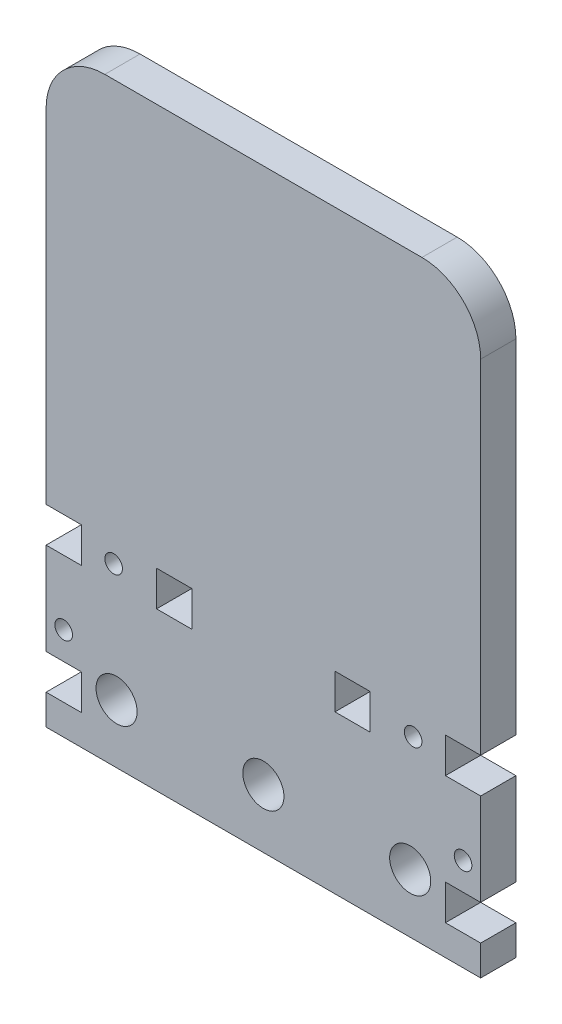
ISO-10303-21;
HEADER;
FILE_DESCRIPTION(('STEP AP214'),'2;1');
FILE_NAME('part.step','',(''),(''),'','','');
FILE_SCHEMA(('AUTOMOTIVE_DESIGN { 1 0 10303 214 1 1 1 1 }'));
ENDSEC;
DATA;
#1=APPLICATION_CONTEXT('core data for automotive mechanical design processes');
#2=APPLICATION_PROTOCOL_DEFINITION('international standard','automotive_design',2000,#1);
#3=PRODUCT_CONTEXT('',#1,'mechanical');
#4=PRODUCT('Part','Part','',(#3));
#5=PRODUCT_RELATED_PRODUCT_CATEGORY('part','',(#4));
#6=PRODUCT_DEFINITION_FORMATION('','',#4);
#7=PRODUCT_DEFINITION_CONTEXT('part definition',#1,'design');
#8=PRODUCT_DEFINITION('design','',#6,#7);
#9=PRODUCT_DEFINITION_SHAPE('','',#8);
#10=(LENGTH_UNIT() NAMED_UNIT(*) SI_UNIT(.MILLI.,.METRE.));
#11=(NAMED_UNIT(*) PLANE_ANGLE_UNIT() SI_UNIT($,.RADIAN.));
#12=(NAMED_UNIT(*) SI_UNIT($,.STERADIAN.) SOLID_ANGLE_UNIT());
#13=UNCERTAINTY_MEASURE_WITH_UNIT(LENGTH_MEASURE(1.E-05),#10,'distance_accuracy_value','');
#14=(GEOMETRIC_REPRESENTATION_CONTEXT(3) GLOBAL_UNCERTAINTY_ASSIGNED_CONTEXT((#13)) GLOBAL_UNIT_ASSIGNED_CONTEXT((#10,
#11,#12)) REPRESENTATION_CONTEXT('',''));
#15=CARTESIAN_POINT('',(0.,0.,0.));
#16=DIRECTION('',(0.,0.,1.));
#17=DIRECTION('',(1.,0.,0.));
#18=AXIS2_PLACEMENT_3D('',#15,#16,#17);
#19=CARTESIAN_POINT('',(0.,32.84,6.));
#20=DIRECTION('',(0.,-1.,0.));
#21=DIRECTION('',(0.,0.,-1.));
#22=AXIS2_PLACEMENT_3D('',#19,#20,#21);
#23=PLANE('',#22);
#24=DIRECTION('',(-1.,0.,0.));
#25=VECTOR('',#24,1.);
#26=CARTESIAN_POINT('',(0.,32.84,0.));
#27=LINE('',#26,#25);
#28=CARTESIAN_POINT('',(55.19,32.84,0.));
#29=VERTEX_POINT('',#28);
#30=CARTESIAN_POINT('',(49.19,32.84,0.));
#31=VERTEX_POINT('',#30);
#32=EDGE_CURVE('E408',#29,#31,#27,.T.);
#33=ORIENTED_EDGE('',*,*,#32,.F.);
#34=DIRECTION('',(0.,0.,-1.));
#35=VECTOR('',#34,1.);
#36=CARTESIAN_POINT('',(55.19,32.84,6.));
#37=LINE('',#36,#35);
#38=CARTESIAN_POINT('',(55.19,32.84,6.));
#39=VERTEX_POINT('',#38);
#40=EDGE_CURVE('E11',#39,#29,#37,.T.);
#41=ORIENTED_EDGE('',*,*,#40,.F.);
#42=DIRECTION('',(-1.,0.,0.));
#43=VECTOR('',#42,1.);
#44=CARTESIAN_POINT('',(0.,32.84,6.));
#45=LINE('',#44,#43);
#46=CARTESIAN_POINT('',(49.19,32.84,6.));
#47=VERTEX_POINT('',#46);
#48=EDGE_CURVE('E249',#39,#47,#45,.T.);
#49=ORIENTED_EDGE('',*,*,#48,.T.);
#50=DIRECTION('',(0.,0.,-1.));
#51=VECTOR('',#50,1.);
#52=CARTESIAN_POINT('',(49.19,32.84,6.));
#53=LINE('',#52,#51);
#54=EDGE_CURVE('E51',#47,#31,#53,.T.);
#55=ORIENTED_EDGE('',*,*,#54,.T.);
#56=EDGE_LOOP('',(#33,#41,#49,#55));
#57=FACE_BOUND('',#56,.T.);
#58=ADVANCED_FACE('F32',(#57),#23,.T.);
#59=CARTESIAN_POINT('',(55.19,0.,6.));
#60=DIRECTION('',(1.,0.,0.));
#61=DIRECTION('',(0.,0.,-1.));
#62=AXIS2_PLACEMENT_3D('',#59,#60,#61);
#63=PLANE('',#62);
#64=DIRECTION('',(0.,-1.,0.));
#65=VECTOR('',#64,1.);
#66=CARTESIAN_POINT('',(55.19,0.,0.));
#67=LINE('',#66,#65);
#68=CARTESIAN_POINT('',(55.19,26.84,0.));
#69=VERTEX_POINT('',#68);
#70=EDGE_CURVE('E254',#29,#69,#67,.T.);
#71=ORIENTED_EDGE('',*,*,#70,.T.);
#72=DIRECTION('',(0.,0.,-1.));
#73=VECTOR('',#72,1.);
#74=CARTESIAN_POINT('',(55.19,26.84,6.));
#75=LINE('',#74,#73);
#76=CARTESIAN_POINT('',(55.19,26.84,6.));
#77=VERTEX_POINT('',#76);
#78=EDGE_CURVE('E42',#77,#69,#75,.T.);
#79=ORIENTED_EDGE('',*,*,#78,.F.);
#80=DIRECTION('',(0.,-1.,0.));
#81=VECTOR('',#80,1.);
#82=CARTESIAN_POINT('',(55.19,0.,6.));
#83=LINE('',#82,#81);
#84=EDGE_CURVE('E244',#39,#77,#83,.T.);
#85=ORIENTED_EDGE('',*,*,#84,.F.);
#86=ORIENTED_EDGE('',*,*,#40,.T.);
#87=EDGE_LOOP('',(#71,#79,#85,#86));
#88=FACE_BOUND('',#87,.T.);
#89=ADVANCED_FACE('F252',(#88),#63,.F.);
#90=CARTESIAN_POINT('',(0.,26.84,6.));
#91=DIRECTION('',(0.,-1.,0.));
#92=DIRECTION('',(0.,0.,-1.));
#93=AXIS2_PLACEMENT_3D('',#90,#91,#92);
#94=PLANE('',#93);
#95=DIRECTION('',(-1.,0.,0.));
#96=VECTOR('',#95,1.);
#97=CARTESIAN_POINT('',(0.,26.84,0.));
#98=LINE('',#97,#96);
#99=CARTESIAN_POINT('',(49.19,26.84,0.));
#100=VERTEX_POINT('',#99);
#101=EDGE_CURVE('E411',#69,#100,#98,.T.);
#102=ORIENTED_EDGE('',*,*,#101,.T.);
#103=DIRECTION('',(0.,0.,-1.));
#104=VECTOR('',#103,1.);
#105=CARTESIAN_POINT('',(49.19,26.84,6.));
#106=LINE('',#105,#104);
#107=CARTESIAN_POINT('',(49.19,26.84,6.));
#108=VERTEX_POINT('',#107);
#109=EDGE_CURVE('E143',#108,#100,#106,.T.);
#110=ORIENTED_EDGE('',*,*,#109,.F.);
#111=DIRECTION('',(-1.,0.,0.));
#112=VECTOR('',#111,1.);
#113=CARTESIAN_POINT('',(0.,26.84,6.));
#114=LINE('',#113,#112);
#115=EDGE_CURVE('E236',#77,#108,#114,.T.);
#116=ORIENTED_EDGE('',*,*,#115,.F.);
#117=ORIENTED_EDGE('',*,*,#78,.T.);
#118=EDGE_LOOP('',(#102,#110,#116,#117));
#119=FACE_BOUND('',#118,.T.);
#120=ADVANCED_FACE('F238',(#119),#94,.F.);
#121=CARTESIAN_POINT('',(0.,32.84,6.));
#122=DIRECTION('',(0.,1.,0.));
#123=DIRECTION('',(0.,0.,1.));
#124=AXIS2_PLACEMENT_3D('',#121,#122,#123);
#125=PLANE('',#124);
#126=DIRECTION('',(1.,0.,0.));
#127=VECTOR('',#126,1.);
#128=CARTESIAN_POINT('',(0.,32.84,0.));
#129=LINE('',#128,#127);
#130=CARTESIAN_POINT('',(18.81,32.84,0.));
#131=VERTEX_POINT('',#130);
#132=CARTESIAN_POINT('',(24.81,32.84,0.));
#133=VERTEX_POINT('',#132);
#134=EDGE_CURVE('E390',#131,#133,#129,.T.);
#135=ORIENTED_EDGE('',*,*,#134,.T.);
#136=DIRECTION('',(0.,0.,-1.));
#137=VECTOR('',#136,1.);
#138=CARTESIAN_POINT('',(24.81,32.84,6.));
#139=LINE('',#138,#137);
#140=CARTESIAN_POINT('',(24.81,32.84,6.));
#141=VERTEX_POINT('',#140);
#142=EDGE_CURVE('E265',#141,#133,#139,.T.);
#143=ORIENTED_EDGE('',*,*,#142,.F.);
#144=DIRECTION('',(1.,0.,0.));
#145=VECTOR('',#144,1.);
#146=CARTESIAN_POINT('',(0.,32.84,6.));
#147=LINE('',#146,#145);
#148=CARTESIAN_POINT('',(18.81,32.84,6.));
#149=VERTEX_POINT('',#148);
#150=EDGE_CURVE('E475',#149,#141,#147,.T.);
#151=ORIENTED_EDGE('',*,*,#150,.F.);
#152=DIRECTION('',(0.,0.,-1.));
#153=VECTOR('',#152,1.);
#154=CARTESIAN_POINT('',(18.81,32.84,6.));
#155=LINE('',#154,#153);
#156=EDGE_CURVE('E259',#149,#131,#155,.T.);
#157=ORIENTED_EDGE('',*,*,#156,.T.);
#158=EDGE_LOOP('',(#135,#143,#151,#157));
#159=FACE_BOUND('',#158,.T.);
#160=ADVANCED_FACE('F585',(#159),#125,.F.);
#161=CARTESIAN_POINT('',(24.81,0.,6.));
#162=DIRECTION('',(1.,0.,0.));
#163=DIRECTION('',(0.,0.,-1.));
#164=AXIS2_PLACEMENT_3D('',#161,#162,#163);
#165=PLANE('',#164);
#166=DIRECTION('',(0.,-1.,0.));
#167=VECTOR('',#166,1.);
#168=CARTESIAN_POINT('',(24.81,0.,0.));
#169=LINE('',#168,#167);
#170=CARTESIAN_POINT('',(24.81,26.84,0.));
#171=VERTEX_POINT('',#170);
#172=EDGE_CURVE('E393',#133,#171,#169,.T.);
#173=ORIENTED_EDGE('',*,*,#172,.T.);
#174=DIRECTION('',(0.,0.,-1.));
#175=VECTOR('',#174,1.);
#176=CARTESIAN_POINT('',(24.81,26.84,6.));
#177=LINE('',#176,#175);
#178=CARTESIAN_POINT('',(24.81,26.84,6.));
#179=VERTEX_POINT('',#178);
#180=EDGE_CURVE('E263',#179,#171,#177,.T.);
#181=ORIENTED_EDGE('',*,*,#180,.F.);
#182=DIRECTION('',(0.,-1.,0.));
#183=VECTOR('',#182,1.);
#184=CARTESIAN_POINT('',(24.81,0.,6.));
#185=LINE('',#184,#183);
#186=EDGE_CURVE('E478',#141,#179,#185,.T.);
#187=ORIENTED_EDGE('',*,*,#186,.F.);
#188=ORIENTED_EDGE('',*,*,#142,.T.);
#189=EDGE_LOOP('',(#173,#181,#187,#188));
#190=FACE_BOUND('',#189,.T.);
#191=ADVANCED_FACE('F581',(#190),#165,.F.);
#192=CARTESIAN_POINT('',(0.,26.84,6.));
#193=DIRECTION('',(0.,1.,0.));
#194=DIRECTION('',(0.,0.,1.));
#195=AXIS2_PLACEMENT_3D('',#192,#193,#194);
#196=PLANE('',#195);
#197=DIRECTION('',(1.,0.,0.));
#198=VECTOR('',#197,1.);
#199=CARTESIAN_POINT('',(0.,26.84,0.));
#200=LINE('',#199,#198);
#201=CARTESIAN_POINT('',(18.81,26.84,0.));
#202=VERTEX_POINT('',#201);
#203=EDGE_CURVE('E396',#202,#171,#200,.T.);
#204=ORIENTED_EDGE('',*,*,#203,.F.);
#205=DIRECTION('',(0.,0.,-1.));
#206=VECTOR('',#205,1.);
#207=CARTESIAN_POINT('',(18.81,26.84,6.));
#208=LINE('',#207,#206);
#209=CARTESIAN_POINT('',(18.81,26.84,6.));
#210=VERTEX_POINT('',#209);
#211=EDGE_CURVE('E261',#210,#202,#208,.T.);
#212=ORIENTED_EDGE('',*,*,#211,.F.);
#213=DIRECTION('',(1.,0.,0.));
#214=VECTOR('',#213,1.);
#215=CARTESIAN_POINT('',(0.,26.84,6.));
#216=LINE('',#215,#214);
#217=EDGE_CURVE('E480',#210,#179,#216,.T.);
#218=ORIENTED_EDGE('',*,*,#217,.T.);
#219=ORIENTED_EDGE('',*,*,#180,.T.);
#220=EDGE_LOOP('',(#204,#212,#218,#219));
#221=FACE_BOUND('',#220,.T.);
#222=ADVANCED_FACE('F578',(#221),#196,.T.);
#223=CARTESIAN_POINT('',(64.,91.26,6.));
#224=DIRECTION('',(0.,0.,-1.));
#225=DIRECTION('',(-1.,0.,0.));
#226=AXIS2_PLACEMENT_3D('',#223,#224,#225);
#227=CYLINDRICAL_SURFACE('',#226,9.99999999999999);
#228=CARTESIAN_POINT('',(64.,91.26,0.));
#229=DIRECTION('',(0.,0.,1.));
#230=DIRECTION('',(1.,0.,0.));
#231=AXIS2_PLACEMENT_3D('',#228,#229,#230);
#232=CIRCLE('',#231,9.99999999999999);
#233=CARTESIAN_POINT('',(63.9999999999999,101.26,0.));
#234=VERTEX_POINT('',#233);
#235=CARTESIAN_POINT('',(74.,91.2599999999999,0.));
#236=VERTEX_POINT('',#235);
#237=EDGE_CURVE('E326',#234,#236,#232,.F.);
#238=ORIENTED_EDGE('',*,*,#237,.F.);
#239=DIRECTION('',(0.,0.,-1.));
#240=VECTOR('',#239,1.);
#241=CARTESIAN_POINT('',(63.9999999999999,101.26,6.));
#242=LINE('',#241,#240);
#243=CARTESIAN_POINT('',(63.9999999999999,101.26,6.));
#244=VERTEX_POINT('',#243);
#245=EDGE_CURVE('E36',#244,#234,#242,.T.);
#246=ORIENTED_EDGE('',*,*,#245,.F.);
#247=CARTESIAN_POINT('',(64.,91.26,6.));
#248=DIRECTION('',(0.,0.,1.));
#249=DIRECTION('',(1.,0.,0.));
#250=AXIS2_PLACEMENT_3D('',#247,#248,#249);
#251=CIRCLE('',#250,9.99999999999999);
#252=CARTESIAN_POINT('',(74.,91.2599999999999,6.));
#253=VERTEX_POINT('',#252);
#254=EDGE_CURVE('E418',#244,#253,#251,.F.);
#255=ORIENTED_EDGE('',*,*,#254,.T.);
#256=DIRECTION('',(0.,0.,-1.));
#257=VECTOR('',#256,1.);
#258=CARTESIAN_POINT('',(74.,91.2599999999999,6.));
#259=LINE('',#258,#257);
#260=EDGE_CURVE('E268',#253,#236,#259,.T.);
#261=ORIENTED_EDGE('',*,*,#260,.T.);
#262=EDGE_LOOP('',(#238,#246,#255,#261));
#263=FACE_BOUND('',#262,.T.);
#264=ADVANCED_FACE('F327',(#263),#227,.T.);
#265=CARTESIAN_POINT('',(0.,101.26,6.));
#266=DIRECTION('',(0.,1.,0.));
#267=DIRECTION('',(0.,0.,1.));
#268=AXIS2_PLACEMENT_3D('',#265,#266,#267);
#269=PLANE('',#268);
#270=DIRECTION('',(1.,0.,0.));
#271=VECTOR('',#270,1.);
#272=CARTESIAN_POINT('',(0.,101.26,0.));
#273=LINE('',#272,#271);
#274=CARTESIAN_POINT('',(10.0000000000001,101.26,0.));
#275=VERTEX_POINT('',#274);
#276=EDGE_CURVE('E321',#275,#234,#273,.T.);
#277=ORIENTED_EDGE('',*,*,#276,.F.);
#278=DIRECTION('',(0.,0.,-1.));
#279=VECTOR('',#278,1.);
#280=CARTESIAN_POINT('',(10.0000000000001,101.26,6.));
#281=LINE('',#280,#279);
#282=CARTESIAN_POINT('',(10.0000000000001,101.26,6.));
#283=VERTEX_POINT('',#282);
#284=EDGE_CURVE('E312',#283,#275,#281,.T.);
#285=ORIENTED_EDGE('',*,*,#284,.F.);
#286=DIRECTION('',(1.,0.,0.));
#287=VECTOR('',#286,1.);
#288=CARTESIAN_POINT('',(0.,101.26,6.));
#289=LINE('',#288,#287);
#290=EDGE_CURVE('E324',#283,#244,#289,.T.);
#291=ORIENTED_EDGE('',*,*,#290,.T.);
#292=ORIENTED_EDGE('',*,*,#245,.T.);
#293=EDGE_LOOP('',(#277,#285,#291,#292));
#294=FACE_BOUND('',#293,.T.);
#295=ADVANCED_FACE('F319',(#294),#269,.T.);
#296=CARTESIAN_POINT('',(10.,91.26,6.));
#297=DIRECTION('',(0.,0.,-1.));
#298=DIRECTION('',(-1.,0.,0.));
#299=AXIS2_PLACEMENT_3D('',#296,#297,#298);
#300=CYLINDRICAL_SURFACE('',#299,10.);
#301=CARTESIAN_POINT('',(10.,91.26,0.));
#302=DIRECTION('',(0.,0.,1.));
#303=DIRECTION('',(1.,0.,0.));
#304=AXIS2_PLACEMENT_3D('',#301,#302,#303);
#305=CIRCLE('',#304,10.);
#306=CARTESIAN_POINT('',(0.,91.2599999999999,0.));
#307=VERTEX_POINT('',#306);
#308=EDGE_CURVE('E337',#307,#275,#305,.F.);
#309=ORIENTED_EDGE('',*,*,#308,.F.);
#310=DIRECTION('',(0.,0.,-1.));
#311=VECTOR('',#310,1.);
#312=CARTESIAN_POINT('',(0.,91.2599999999999,6.));
#313=LINE('',#312,#311);
#314=CARTESIAN_POINT('',(0.,91.2599999999999,6.));
#315=VERTEX_POINT('',#314);
#316=EDGE_CURVE('E311',#315,#307,#313,.T.);
#317=ORIENTED_EDGE('',*,*,#316,.F.);
#318=CARTESIAN_POINT('',(10.,91.26,6.));
#319=DIRECTION('',(0.,0.,1.));
#320=DIRECTION('',(1.,0.,0.));
#321=AXIS2_PLACEMENT_3D('',#318,#319,#320);
#322=CIRCLE('',#321,10.);
#323=EDGE_CURVE('E428',#315,#283,#322,.F.);
#324=ORIENTED_EDGE('',*,*,#323,.T.);
#325=ORIENTED_EDGE('',*,*,#284,.T.);
#326=EDGE_LOOP('',(#309,#317,#324,#325));
#327=FACE_BOUND('',#326,.T.);
#328=ADVANCED_FACE('F652',(#327),#300,.T.);
#329=CARTESIAN_POINT('',(0.,0.,6.));
#330=DIRECTION('',(-1.,0.,0.));
#331=DIRECTION('',(0.,0.,1.));
#332=AXIS2_PLACEMENT_3D('',#329,#330,#331);
#333=PLANE('',#332);
#334=DIRECTION('',(0.,1.,0.));
#335=VECTOR('',#334,1.);
#336=CARTESIAN_POINT('',(0.,0.,0.));
#337=LINE('',#336,#335);
#338=CARTESIAN_POINT('',(0.,32.84,0.));
#339=VERTEX_POINT('',#338);
#340=EDGE_CURVE('E339',#339,#307,#337,.T.);
#341=ORIENTED_EDGE('',*,*,#340,.F.);
#342=DIRECTION('',(0.,0.,-1.));
#343=VECTOR('',#342,1.);
#344=CARTESIAN_POINT('',(0.,32.84,6.));
#345=LINE('',#344,#343);
#346=CARTESIAN_POINT('',(0.,32.84,6.));
#347=VERTEX_POINT('',#346);
#348=EDGE_CURVE('E309',#347,#339,#345,.T.);
#349=ORIENTED_EDGE('',*,*,#348,.F.);
#350=DIRECTION('',(0.,1.,0.));
#351=VECTOR('',#350,1.);
#352=CARTESIAN_POINT('',(0.,0.,6.));
#353=LINE('',#352,#351);
#354=EDGE_CURVE('E430',#347,#315,#353,.T.);
#355=ORIENTED_EDGE('',*,*,#354,.T.);
#356=ORIENTED_EDGE('',*,*,#316,.T.);
#357=EDGE_LOOP('',(#341,#349,#355,#356));
#358=FACE_BOUND('',#357,.T.);
#359=ADVANCED_FACE('F627',(#358),#333,.T.);
#360=CARTESIAN_POINT('',(0.,32.84,6.));
#361=DIRECTION('',(0.,1.,0.));
#362=DIRECTION('',(0.,0.,1.));
#363=AXIS2_PLACEMENT_3D('',#360,#361,#362);
#364=PLANE('',#363);
#365=DIRECTION('',(1.,0.,0.));
#366=VECTOR('',#365,1.);
#367=CARTESIAN_POINT('',(0.,32.84,0.));
#368=LINE('',#367,#366);
#369=CARTESIAN_POINT('',(6.,32.84,0.));
#370=VERTEX_POINT('',#369);
#371=EDGE_CURVE('E344',#339,#370,#368,.T.);
#372=ORIENTED_EDGE('',*,*,#371,.T.);
#373=DIRECTION('',(0.,0.,-1.));
#374=VECTOR('',#373,1.);
#375=CARTESIAN_POINT('',(6.,32.84,6.));
#376=LINE('',#375,#374);
#377=CARTESIAN_POINT('',(6.,32.84,6.));
#378=VERTEX_POINT('',#377);
#379=EDGE_CURVE('E306',#378,#370,#376,.T.);
#380=ORIENTED_EDGE('',*,*,#379,.F.);
#381=DIRECTION('',(1.,0.,0.));
#382=VECTOR('',#381,1.);
#383=CARTESIAN_POINT('',(0.,32.84,6.));
#384=LINE('',#383,#382);
#385=EDGE_CURVE('E433',#347,#378,#384,.T.);
#386=ORIENTED_EDGE('',*,*,#385,.F.);
#387=ORIENTED_EDGE('',*,*,#348,.T.);
#388=EDGE_LOOP('',(#372,#380,#386,#387));
#389=FACE_BOUND('',#388,.T.);
#390=ADVANCED_FACE('F647',(#389),#364,.F.);
#391=CARTESIAN_POINT('',(6.00000000000001,0.,6.));
#392=DIRECTION('',(1.,0.,0.));
#393=DIRECTION('',(0.,1.,0.));
#394=AXIS2_PLACEMENT_3D('',#391,#392,#393);
#395=PLANE('',#394);
#396=DIRECTION('',(0.,-1.,0.));
#397=VECTOR('',#396,1.);
#398=CARTESIAN_POINT('',(6.00000000000001,0.,0.));
#399=LINE('',#398,#397);
#400=CARTESIAN_POINT('',(6.,26.84,0.));
#401=VERTEX_POINT('',#400);
#402=EDGE_CURVE('E349',#370,#401,#399,.T.);
#403=ORIENTED_EDGE('',*,*,#402,.T.);
#404=DIRECTION('',(0.,0.,-1.));
#405=VECTOR('',#404,1.);
#406=CARTESIAN_POINT('',(6.,26.84,6.));
#407=LINE('',#406,#405);
#408=CARTESIAN_POINT('',(6.,26.84,6.));
#409=VERTEX_POINT('',#408);
#410=EDGE_CURVE('E304',#409,#401,#407,.T.);
#411=ORIENTED_EDGE('',*,*,#410,.F.);
#412=DIRECTION('',(0.,-1.,0.));
#413=VECTOR('',#412,1.);
#414=CARTESIAN_POINT('',(6.00000000000001,0.,6.));
#415=LINE('',#414,#413);
#416=EDGE_CURVE('E438',#378,#409,#415,.T.);
#417=ORIENTED_EDGE('',*,*,#416,.F.);
#418=ORIENTED_EDGE('',*,*,#379,.T.);
#419=EDGE_LOOP('',(#403,#411,#417,#418));
#420=FACE_BOUND('',#419,.T.);
#421=ADVANCED_FACE('F643',(#420),#395,.F.);
#422=CARTESIAN_POINT('',(0.,26.84,6.));
#423=DIRECTION('',(0.,1.,0.));
#424=DIRECTION('',(0.,0.,1.));
#425=AXIS2_PLACEMENT_3D('',#422,#423,#424);
#426=PLANE('',#425);
#427=DIRECTION('',(1.,0.,0.));
#428=VECTOR('',#427,1.);
#429=CARTESIAN_POINT('',(0.,26.84,0.));
#430=LINE('',#429,#428);
#431=CARTESIAN_POINT('',(0.,26.84,0.));
#432=VERTEX_POINT('',#431);
#433=EDGE_CURVE('E352',#432,#401,#430,.T.);
#434=ORIENTED_EDGE('',*,*,#433,.F.);
#435=DIRECTION('',(0.,0.,-1.));
#436=VECTOR('',#435,1.);
#437=CARTESIAN_POINT('',(0.,26.84,6.));
#438=LINE('',#437,#436);
#439=CARTESIAN_POINT('',(0.,26.84,6.));
#440=VERTEX_POINT('',#439);
#441=EDGE_CURVE('E302',#440,#432,#438,.T.);
#442=ORIENTED_EDGE('',*,*,#441,.F.);
#443=DIRECTION('',(1.,0.,0.));
#444=VECTOR('',#443,1.);
#445=CARTESIAN_POINT('',(0.,26.84,6.));
#446=LINE('',#445,#444);
#447=EDGE_CURVE('E440',#440,#409,#446,.T.);
#448=ORIENTED_EDGE('',*,*,#447,.T.);
#449=ORIENTED_EDGE('',*,*,#410,.T.);
#450=EDGE_LOOP('',(#434,#442,#448,#449));
#451=FACE_BOUND('',#450,.T.);
#452=ADVANCED_FACE('F640',(#451),#426,.T.);
#453=CARTESIAN_POINT('',(0.,11.15,0.));
#454=VERTEX_POINT('',#453);
#455=EDGE_CURVE('E346',#454,#432,#337,.T.);
#456=ORIENTED_EDGE('',*,*,#455,.F.);
#457=DIRECTION('',(0.,0.,-1.));
#458=VECTOR('',#457,1.);
#459=CARTESIAN_POINT('',(0.,11.15,6.));
#460=LINE('',#459,#458);
#461=CARTESIAN_POINT('',(0.,11.15,6.));
#462=VERTEX_POINT('',#461);
#463=EDGE_CURVE('E300',#462,#454,#460,.T.);
#464=ORIENTED_EDGE('',*,*,#463,.F.);
#465=EDGE_CURVE('E435',#462,#440,#353,.T.);
#466=ORIENTED_EDGE('',*,*,#465,.T.);
#467=ORIENTED_EDGE('',*,*,#441,.T.);
#468=EDGE_LOOP('',(#456,#464,#466,#467));
#469=FACE_BOUND('',#468,.T.);
#470=ADVANCED_FACE('F628',(#469),#333,.T.);
#471=CARTESIAN_POINT('',(0.,11.15,6.));
#472=DIRECTION('',(0.,1.,0.));
#473=DIRECTION('',(0.,0.,1.));
#474=AXIS2_PLACEMENT_3D('',#471,#472,#473);
#475=PLANE('',#474);
#476=DIRECTION('',(1.,0.,0.));
#477=VECTOR('',#476,1.);
#478=CARTESIAN_POINT('',(0.,11.15,0.));
#479=LINE('',#478,#477);
#480=CARTESIAN_POINT('',(6.,11.15,0.));
#481=VERTEX_POINT('',#480);
#482=EDGE_CURVE('E355',#454,#481,#479,.T.);
#483=ORIENTED_EDGE('',*,*,#482,.T.);
#484=DIRECTION('',(0.,0.,-1.));
#485=VECTOR('',#484,1.);
#486=CARTESIAN_POINT('',(6.,11.15,6.));
#487=LINE('',#486,#485);
#488=CARTESIAN_POINT('',(6.,11.15,6.));
#489=VERTEX_POINT('',#488);
#490=EDGE_CURVE('E297',#489,#481,#487,.T.);
#491=ORIENTED_EDGE('',*,*,#490,.F.);
#492=DIRECTION('',(1.,0.,0.));
#493=VECTOR('',#492,1.);
#494=CARTESIAN_POINT('',(0.,11.15,6.));
#495=LINE('',#494,#493);
#496=EDGE_CURVE('E443',#462,#489,#495,.T.);
#497=ORIENTED_EDGE('',*,*,#496,.F.);
#498=ORIENTED_EDGE('',*,*,#463,.T.);
#499=EDGE_LOOP('',(#483,#491,#497,#498));
#500=FACE_BOUND('',#499,.T.);
#501=ADVANCED_FACE('F635',(#500),#475,.F.);
#502=CARTESIAN_POINT('',(6.,0.,6.));
#503=DIRECTION('',(1.,0.,0.));
#504=DIRECTION('',(0.,1.,0.));
#505=AXIS2_PLACEMENT_3D('',#502,#503,#504);
#506=PLANE('',#505);
#507=DIRECTION('',(0.,-1.,0.));
#508=VECTOR('',#507,1.);
#509=CARTESIAN_POINT('',(6.,0.,0.));
#510=LINE('',#509,#508);
#511=CARTESIAN_POINT('',(6.,5.15,0.));
#512=VERTEX_POINT('',#511);
#513=EDGE_CURVE('E358',#481,#512,#510,.T.);
#514=ORIENTED_EDGE('',*,*,#513,.T.);
#515=DIRECTION('',(0.,0.,-1.));
#516=VECTOR('',#515,1.);
#517=CARTESIAN_POINT('',(6.,5.15,6.));
#518=LINE('',#517,#516);
#519=CARTESIAN_POINT('',(6.,5.15,6.));
#520=VERTEX_POINT('',#519);
#521=EDGE_CURVE('E295',#520,#512,#518,.T.);
#522=ORIENTED_EDGE('',*,*,#521,.F.);
#523=DIRECTION('',(0.,-1.,0.));
#524=VECTOR('',#523,1.);
#525=CARTESIAN_POINT('',(6.,0.,6.));
#526=LINE('',#525,#524);
#527=EDGE_CURVE('E446',#489,#520,#526,.T.);
#528=ORIENTED_EDGE('',*,*,#527,.F.);
#529=ORIENTED_EDGE('',*,*,#490,.T.);
#530=EDGE_LOOP('',(#514,#522,#528,#529));
#531=FACE_BOUND('',#530,.T.);
#532=ADVANCED_FACE('F631',(#531),#506,.F.);
#533=CARTESIAN_POINT('',(0.,5.15,6.));
#534=DIRECTION('',(0.,1.,0.));
#535=DIRECTION('',(0.,0.,1.));
#536=AXIS2_PLACEMENT_3D('',#533,#534,#535);
#537=PLANE('',#536);
#538=DIRECTION('',(1.,0.,0.));
#539=VECTOR('',#538,1.);
#540=CARTESIAN_POINT('',(0.,5.15,0.));
#541=LINE('',#540,#539);
#542=CARTESIAN_POINT('',(0.,5.15,0.));
#543=VERTEX_POINT('',#542);
#544=EDGE_CURVE('E361',#543,#512,#541,.T.);
#545=ORIENTED_EDGE('',*,*,#544,.F.);
#546=DIRECTION('',(0.,0.,-1.));
#547=VECTOR('',#546,1.);
#548=CARTESIAN_POINT('',(0.,5.15,6.));
#549=LINE('',#548,#547);
#550=CARTESIAN_POINT('',(0.,5.15,6.));
#551=VERTEX_POINT('',#550);
#552=EDGE_CURVE('E293',#551,#543,#549,.T.);
#553=ORIENTED_EDGE('',*,*,#552,.F.);
#554=DIRECTION('',(1.,0.,0.));
#555=VECTOR('',#554,1.);
#556=CARTESIAN_POINT('',(0.,5.15,6.));
#557=LINE('',#556,#555);
#558=EDGE_CURVE('E448',#551,#520,#557,.T.);
#559=ORIENTED_EDGE('',*,*,#558,.T.);
#560=ORIENTED_EDGE('',*,*,#521,.T.);
#561=EDGE_LOOP('',(#545,#553,#559,#560));
#562=FACE_BOUND('',#561,.T.);
#563=ADVANCED_FACE('F625',(#562),#537,.T.);
#564=CARTESIAN_POINT('',(0.,0.,0.));
#565=VERTEX_POINT('',#564);
#566=EDGE_CURVE('E345',#565,#543,#337,.T.);
#567=ORIENTED_EDGE('',*,*,#566,.F.);
#568=DIRECTION('',(0.,0.,-1.));
#569=VECTOR('',#568,1.);
#570=CARTESIAN_POINT('',(0.,0.,6.));
#571=LINE('',#570,#569);
#572=CARTESIAN_POINT('',(0.,0.,6.));
#573=VERTEX_POINT('',#572);
#574=EDGE_CURVE('E291',#573,#565,#571,.T.);
#575=ORIENTED_EDGE('',*,*,#574,.F.);
#576=EDGE_CURVE('E434',#573,#551,#353,.T.);
#577=ORIENTED_EDGE('',*,*,#576,.T.);
#578=ORIENTED_EDGE('',*,*,#552,.T.);
#579=EDGE_LOOP('',(#567,#575,#577,#578));
#580=FACE_BOUND('',#579,.T.);
#581=ADVANCED_FACE('F621',(#580),#333,.T.);
#582=CARTESIAN_POINT('',(0.,0.,6.));
#583=DIRECTION('',(0.,1.,0.));
#584=DIRECTION('',(0.,0.,1.));
#585=AXIS2_PLACEMENT_3D('',#582,#583,#584);
#586=PLANE('',#585);
#587=DIRECTION('',(1.,0.,0.));
#588=VECTOR('',#587,1.);
#589=CARTESIAN_POINT('',(0.,0.,0.));
#590=LINE('',#589,#588);
#591=CARTESIAN_POINT('',(74.,0.,0.));
#592=VERTEX_POINT('',#591);
#593=EDGE_CURVE('E364',#565,#592,#590,.T.);
#594=ORIENTED_EDGE('',*,*,#593,.T.);
#595=DIRECTION('',(0.,0.,-1.));
#596=VECTOR('',#595,1.);
#597=CARTESIAN_POINT('',(74.,0.,6.));
#598=LINE('',#597,#596);
#599=CARTESIAN_POINT('',(74.,0.,6.));
#600=VERTEX_POINT('',#599);
#601=EDGE_CURVE('E288',#600,#592,#598,.T.);
#602=ORIENTED_EDGE('',*,*,#601,.F.);
#603=DIRECTION('',(1.,0.,0.));
#604=VECTOR('',#603,1.);
#605=CARTESIAN_POINT('',(0.,0.,6.));
#606=LINE('',#605,#604);
#607=EDGE_CURVE('E451',#573,#600,#606,.T.);
#608=ORIENTED_EDGE('',*,*,#607,.F.);
#609=ORIENTED_EDGE('',*,*,#574,.T.);
#610=EDGE_LOOP('',(#594,#602,#608,#609));
#611=FACE_BOUND('',#610,.T.);
#612=ADVANCED_FACE('F618',(#611),#586,.F.);
#613=CARTESIAN_POINT('',(74.,0.,6.));
#614=DIRECTION('',(-1.,0.,0.));
#615=DIRECTION('',(0.,0.,1.));
#616=AXIS2_PLACEMENT_3D('',#613,#614,#615);
#617=PLANE('',#616);
#618=DIRECTION('',(0.,1.,0.));
#619=VECTOR('',#618,1.);
#620=CARTESIAN_POINT('',(74.,0.,0.));
#621=LINE('',#620,#619);
#622=CARTESIAN_POINT('',(74.,5.15,0.));
#623=VERTEX_POINT('',#622);
#624=EDGE_CURVE('E367',#592,#623,#621,.T.);
#625=ORIENTED_EDGE('',*,*,#624,.T.);
#626=DIRECTION('',(0.,0.,-1.));
#627=VECTOR('',#626,1.);
#628=CARTESIAN_POINT('',(74.,5.15,6.));
#629=LINE('',#628,#627);
#630=CARTESIAN_POINT('',(74.,5.15,6.));
#631=VERTEX_POINT('',#630);
#632=EDGE_CURVE('E285',#631,#623,#629,.T.);
#633=ORIENTED_EDGE('',*,*,#632,.F.);
#634=DIRECTION('',(0.,1.,0.));
#635=VECTOR('',#634,1.);
#636=CARTESIAN_POINT('',(74.,0.,6.));
#637=LINE('',#636,#635);
#638=EDGE_CURVE('E454',#600,#631,#637,.T.);
#639=ORIENTED_EDGE('',*,*,#638,.F.);
#640=ORIENTED_EDGE('',*,*,#601,.T.);
#641=EDGE_LOOP('',(#625,#633,#639,#640));
#642=FACE_BOUND('',#641,.T.);
#643=ADVANCED_FACE('F593',(#642),#617,.F.);
#644=CARTESIAN_POINT('',(0.,5.15,6.));
#645=DIRECTION('',(0.,-1.,0.));
#646=DIRECTION('',(0.,0.,-1.));
#647=AXIS2_PLACEMENT_3D('',#644,#645,#646);
#648=PLANE('',#647);
#649=DIRECTION('',(-1.,0.,0.));
#650=VECTOR('',#649,1.);
#651=CARTESIAN_POINT('',(0.,5.15,0.));
#652=LINE('',#651,#650);
#653=CARTESIAN_POINT('',(68.,5.15,0.));
#654=VERTEX_POINT('',#653);
#655=EDGE_CURVE('E370',#623,#654,#652,.T.);
#656=ORIENTED_EDGE('',*,*,#655,.T.);
#657=DIRECTION('',(0.,0.,-1.));
#658=VECTOR('',#657,1.);
#659=CARTESIAN_POINT('',(68.,5.15,6.));
#660=LINE('',#659,#658);
#661=CARTESIAN_POINT('',(68.,5.15,6.));
#662=VERTEX_POINT('',#661);
#663=EDGE_CURVE('E283',#662,#654,#660,.T.);
#664=ORIENTED_EDGE('',*,*,#663,.F.);
#665=DIRECTION('',(-1.,0.,0.));
#666=VECTOR('',#665,1.);
#667=CARTESIAN_POINT('',(0.,5.15,6.));
#668=LINE('',#667,#666);
#669=EDGE_CURVE('E457',#631,#662,#668,.T.);
#670=ORIENTED_EDGE('',*,*,#669,.F.);
#671=ORIENTED_EDGE('',*,*,#632,.T.);
#672=EDGE_LOOP('',(#656,#664,#670,#671));
#673=FACE_BOUND('',#672,.T.);
#674=ADVANCED_FACE('F613',(#673),#648,.F.);
#675=CARTESIAN_POINT('',(68.,0.,6.));
#676=DIRECTION('',(1.,0.,0.));
#677=DIRECTION('',(0.,0.,-1.));
#678=AXIS2_PLACEMENT_3D('',#675,#676,#677);
#679=PLANE('',#678);
#680=DIRECTION('',(0.,-1.,0.));
#681=VECTOR('',#680,1.);
#682=CARTESIAN_POINT('',(68.,0.,0.));
#683=LINE('',#682,#681);
#684=CARTESIAN_POINT('',(68.,11.15,0.));
#685=VERTEX_POINT('',#684);
#686=EDGE_CURVE('E375',#685,#654,#683,.T.);
#687=ORIENTED_EDGE('',*,*,#686,.F.);
#688=DIRECTION('',(0.,0.,-1.));
#689=VECTOR('',#688,1.);
#690=CARTESIAN_POINT('',(68.,11.15,6.));
#691=LINE('',#690,#689);
#692=CARTESIAN_POINT('',(68.,11.15,6.));
#693=VERTEX_POINT('',#692);
#694=EDGE_CURVE('E281',#693,#685,#691,.T.);
#695=ORIENTED_EDGE('',*,*,#694,.F.);
#696=DIRECTION('',(0.,-1.,0.));
#697=VECTOR('',#696,1.);
#698=CARTESIAN_POINT('',(68.,0.,6.));
#699=LINE('',#698,#697);
#700=EDGE_CURVE('E461',#693,#662,#699,.T.);
#701=ORIENTED_EDGE('',*,*,#700,.T.);
#702=ORIENTED_EDGE('',*,*,#663,.T.);
#703=EDGE_LOOP('',(#687,#695,#701,#702));
#704=FACE_BOUND('',#703,.T.);
#705=ADVANCED_FACE('F609',(#704),#679,.T.);
#706=CARTESIAN_POINT('',(0.,11.15,6.));
#707=DIRECTION('',(0.,-1.,0.));
#708=DIRECTION('',(0.,0.,-1.));
#709=AXIS2_PLACEMENT_3D('',#706,#707,#708);
#710=PLANE('',#709);
#711=DIRECTION('',(-1.,0.,0.));
#712=VECTOR('',#711,1.);
#713=CARTESIAN_POINT('',(0.,11.15,0.));
#714=LINE('',#713,#712);
#715=CARTESIAN_POINT('',(74.,11.15,0.));
#716=VERTEX_POINT('',#715);
#717=EDGE_CURVE('E378',#716,#685,#714,.T.);
#718=ORIENTED_EDGE('',*,*,#717,.F.);
#719=DIRECTION('',(0.,0.,-1.));
#720=VECTOR('',#719,1.);
#721=CARTESIAN_POINT('',(74.,11.15,6.));
#722=LINE('',#721,#720);
#723=CARTESIAN_POINT('',(74.,11.15,6.));
#724=VERTEX_POINT('',#723);
#725=EDGE_CURVE('E279',#724,#716,#722,.T.);
#726=ORIENTED_EDGE('',*,*,#725,.F.);
#727=DIRECTION('',(-1.,0.,0.));
#728=VECTOR('',#727,1.);
#729=CARTESIAN_POINT('',(0.,11.15,6.));
#730=LINE('',#729,#728);
#731=EDGE_CURVE('E464',#724,#693,#730,.T.);
#732=ORIENTED_EDGE('',*,*,#731,.T.);
#733=ORIENTED_EDGE('',*,*,#694,.T.);
#734=EDGE_LOOP('',(#718,#726,#732,#733));
#735=FACE_BOUND('',#734,.T.);
#736=ADVANCED_FACE('F606',(#735),#710,.T.);
#737=CARTESIAN_POINT('',(74.,26.84,0.));
#738=VERTEX_POINT('',#737);
#739=EDGE_CURVE('E372',#716,#738,#621,.T.);
#740=ORIENTED_EDGE('',*,*,#739,.T.);
#741=DIRECTION('',(0.,0.,-1.));
#742=VECTOR('',#741,1.);
#743=CARTESIAN_POINT('',(74.,26.84,6.));
#744=LINE('',#743,#742);
#745=CARTESIAN_POINT('',(74.,26.84,6.));
#746=VERTEX_POINT('',#745);
#747=EDGE_CURVE('E276',#746,#738,#744,.T.);
#748=ORIENTED_EDGE('',*,*,#747,.F.);
#749=EDGE_CURVE('E459',#724,#746,#637,.T.);
#750=ORIENTED_EDGE('',*,*,#749,.F.);
#751=ORIENTED_EDGE('',*,*,#725,.T.);
#752=EDGE_LOOP('',(#740,#748,#750,#751));
#753=FACE_BOUND('',#752,.T.);
#754=ADVANCED_FACE('F594',(#753),#617,.F.);
#755=CARTESIAN_POINT('',(0.,26.84,6.));
#756=DIRECTION('',(0.,-1.,0.));
#757=DIRECTION('',(0.,0.,-1.));
#758=AXIS2_PLACEMENT_3D('',#755,#756,#757);
#759=PLANE('',#758);
#760=DIRECTION('',(-1.,0.,0.));
#761=VECTOR('',#760,1.);
#762=CARTESIAN_POINT('',(0.,26.84,0.));
#763=LINE('',#762,#761);
#764=CARTESIAN_POINT('',(68.,26.84,0.));
#765=VERTEX_POINT('',#764);
#766=EDGE_CURVE('E381',#738,#765,#763,.T.);
#767=ORIENTED_EDGE('',*,*,#766,.T.);
#768=DIRECTION('',(0.,0.,-1.));
#769=VECTOR('',#768,1.);
#770=CARTESIAN_POINT('',(68.,26.84,6.));
#771=LINE('',#770,#769);
#772=CARTESIAN_POINT('',(68.,26.84,6.));
#773=VERTEX_POINT('',#772);
#774=EDGE_CURVE('E274',#773,#765,#771,.T.);
#775=ORIENTED_EDGE('',*,*,#774,.F.);
#776=DIRECTION('',(-1.,0.,0.));
#777=VECTOR('',#776,1.);
#778=CARTESIAN_POINT('',(0.,26.84,6.));
#779=LINE('',#778,#777);
#780=EDGE_CURVE('E467',#746,#773,#779,.T.);
#781=ORIENTED_EDGE('',*,*,#780,.F.);
#782=ORIENTED_EDGE('',*,*,#747,.T.);
#783=EDGE_LOOP('',(#767,#775,#781,#782));
#784=FACE_BOUND('',#783,.T.);
#785=ADVANCED_FACE('F601',(#784),#759,.F.);
#786=CARTESIAN_POINT('',(68.,0.,6.));
#787=DIRECTION('',(1.,0.,0.));
#788=DIRECTION('',(0.,0.,-1.));
#789=AXIS2_PLACEMENT_3D('',#786,#787,#788);
#790=PLANE('',#789);
#791=DIRECTION('',(0.,-1.,0.));
#792=VECTOR('',#791,1.);
#793=CARTESIAN_POINT('',(68.,0.,0.));
#794=LINE('',#793,#792);
#795=CARTESIAN_POINT('',(68.,32.84,0.));
#796=VERTEX_POINT('',#795);
#797=EDGE_CURVE('E384',#796,#765,#794,.T.);
#798=ORIENTED_EDGE('',*,*,#797,.F.);
#799=DIRECTION('',(0.,0.,-1.));
#800=VECTOR('',#799,1.);
#801=CARTESIAN_POINT('',(68.,32.84,6.));
#802=LINE('',#801,#800);
#803=CARTESIAN_POINT('',(68.,32.84,6.));
#804=VERTEX_POINT('',#803);
#805=EDGE_CURVE('E272',#804,#796,#802,.T.);
#806=ORIENTED_EDGE('',*,*,#805,.F.);
#807=DIRECTION('',(0.,-1.,0.));
#808=VECTOR('',#807,1.);
#809=CARTESIAN_POINT('',(68.,0.,6.));
#810=LINE('',#809,#808);
#811=EDGE_CURVE('E469',#804,#773,#810,.T.);
#812=ORIENTED_EDGE('',*,*,#811,.T.);
#813=ORIENTED_EDGE('',*,*,#774,.T.);
#814=EDGE_LOOP('',(#798,#806,#812,#813));
#815=FACE_BOUND('',#814,.T.);
#816=ADVANCED_FACE('F597',(#815),#790,.T.);
#817=CARTESIAN_POINT('',(0.,32.84,6.));
#818=DIRECTION('',(0.,-1.,0.));
#819=DIRECTION('',(0.,0.,-1.));
#820=AXIS2_PLACEMENT_3D('',#817,#818,#819);
#821=PLANE('',#820);
#822=DIRECTION('',(-1.,0.,0.));
#823=VECTOR('',#822,1.);
#824=CARTESIAN_POINT('',(0.,32.84,0.));
#825=LINE('',#824,#823);
#826=CARTESIAN_POINT('',(74.,32.84,0.));
#827=VERTEX_POINT('',#826);
#828=EDGE_CURVE('E387',#827,#796,#825,.T.);
#829=ORIENTED_EDGE('',*,*,#828,.F.);
#830=DIRECTION('',(0.,0.,-1.));
#831=VECTOR('',#830,1.);
#832=CARTESIAN_POINT('',(74.,32.84,6.));
#833=LINE('',#832,#831);
#834=CARTESIAN_POINT('',(74.,32.84,6.));
#835=VERTEX_POINT('',#834);
#836=EDGE_CURVE('E270',#835,#827,#833,.T.);
#837=ORIENTED_EDGE('',*,*,#836,.F.);
#838=DIRECTION('',(-1.,0.,0.));
#839=VECTOR('',#838,1.);
#840=CARTESIAN_POINT('',(0.,32.84,6.));
#841=LINE('',#840,#839);
#842=EDGE_CURVE('E472',#835,#804,#841,.T.);
#843=ORIENTED_EDGE('',*,*,#842,.T.);
#844=ORIENTED_EDGE('',*,*,#805,.T.);
#845=EDGE_LOOP('',(#829,#837,#843,#844));
#846=FACE_BOUND('',#845,.T.);
#847=ADVANCED_FACE('F549',(#846),#821,.T.);
#848=CARTESIAN_POINT('',(62.,9.99999999999999,6.));
#849=DIRECTION('',(0.,0.,-1.));
#850=DIRECTION('',(-1.,0.,0.));
#851=AXIS2_PLACEMENT_3D('',#848,#849,#850);
#852=CYLINDRICAL_SURFACE('',#851,3.5);
#853=CARTESIAN_POINT('',(62.,9.99999999999999,6.));
#854=DIRECTION('',(0.,0.,1.));
#855=DIRECTION('',(1.,0.,0.));
#856=AXIS2_PLACEMENT_3D('',#853,#854,#855);
#857=CIRCLE('',#856,3.5);
#858=CARTESIAN_POINT('',(65.5,9.99999999999999,6.));
#859=VERTEX_POINT('',#858);
#860=EDGE_CURVE('E489',#859,#859,#857,.F.);
#861=ORIENTED_EDGE('',*,*,#860,.F.);
#862=EDGE_LOOP('',(#861));
#863=FACE_BOUND('',#862,.T.);
#864=CARTESIAN_POINT('',(62.,9.99999999999999,0.));
#865=DIRECTION('',(0.,0.,1.));
#866=DIRECTION('',(1.,0.,0.));
#867=AXIS2_PLACEMENT_3D('',#864,#865,#866);
#868=CIRCLE('',#867,3.5);
#869=CARTESIAN_POINT('',(65.5,9.99999999999999,0.));
#870=VERTEX_POINT('',#869);
#871=EDGE_CURVE('E405',#870,#870,#868,.F.);
#872=ORIENTED_EDGE('',*,*,#871,.T.);
#873=EDGE_LOOP('',(#872));
#874=FACE_BOUND('',#873,.T.);
#875=ADVANCED_FACE('F545',(#863,#874),#852,.F.);
#876=CARTESIAN_POINT('',(12.,9.99999999999999,6.));
#877=DIRECTION('',(0.,0.,-1.));
#878=DIRECTION('',(-1.,0.,0.));
#879=AXIS2_PLACEMENT_3D('',#876,#877,#878);
#880=CYLINDRICAL_SURFACE('',#879,3.5);
#881=CARTESIAN_POINT('',(12.,9.99999999999999,6.));
#882=DIRECTION('',(0.,0.,1.));
#883=DIRECTION('',(1.,0.,0.));
#884=AXIS2_PLACEMENT_3D('',#881,#882,#883);
#885=CIRCLE('',#884,3.5);
#886=CARTESIAN_POINT('',(15.5,9.99999999999999,6.));
#887=VERTEX_POINT('',#886);
#888=EDGE_CURVE('E486',#887,#887,#885,.T.);
#889=ORIENTED_EDGE('',*,*,#888,.T.);
#890=EDGE_LOOP('',(#889));
#891=FACE_BOUND('',#890,.T.);
#892=CARTESIAN_POINT('',(12.,9.99999999999999,0.));
#893=DIRECTION('',(0.,0.,1.));
#894=DIRECTION('',(1.,0.,0.));
#895=AXIS2_PLACEMENT_3D('',#892,#893,#894);
#896=CIRCLE('',#895,3.5);
#897=CARTESIAN_POINT('',(15.5,9.99999999999999,0.));
#898=VERTEX_POINT('',#897);
#899=EDGE_CURVE('E402',#898,#898,#896,.T.);
#900=ORIENTED_EDGE('',*,*,#899,.F.);
#901=EDGE_LOOP('',(#900));
#902=FACE_BOUND('',#901,.T.);
#903=ADVANCED_FACE('F548',(#891,#902),#880,.F.);
#904=CARTESIAN_POINT('',(18.81,0.,6.));
#905=DIRECTION('',(1.,0.,0.));
#906=DIRECTION('',(0.,0.,-1.));
#907=AXIS2_PLACEMENT_3D('',#904,#905,#906);
#908=PLANE('',#907);
#909=DIRECTION('',(0.,-1.,0.));
#910=VECTOR('',#909,1.);
#911=CARTESIAN_POINT('',(18.81,0.,0.));
#912=LINE('',#911,#910);
#913=EDGE_CURVE('E399',#131,#202,#912,.T.);
#914=ORIENTED_EDGE('',*,*,#913,.F.);
#915=ORIENTED_EDGE('',*,*,#156,.F.);
#916=DIRECTION('',(0.,-1.,0.));
#917=VECTOR('',#916,1.);
#918=CARTESIAN_POINT('',(18.81,0.,6.));
#919=LINE('',#918,#917);
#920=EDGE_CURVE('E483',#149,#210,#919,.T.);
#921=ORIENTED_EDGE('',*,*,#920,.T.);
#922=ORIENTED_EDGE('',*,*,#211,.T.);
#923=EDGE_LOOP('',(#914,#915,#921,#922));
#924=FACE_BOUND('',#923,.T.);
#925=ADVANCED_FACE('F573',(#924),#908,.T.);
#926=EDGE_CURVE('E371',#827,#236,#621,.T.);
#927=ORIENTED_EDGE('',*,*,#926,.T.);
#928=ORIENTED_EDGE('',*,*,#260,.F.);
#929=EDGE_CURVE('E458',#835,#253,#637,.T.);
#930=ORIENTED_EDGE('',*,*,#929,.F.);
#931=ORIENTED_EDGE('',*,*,#836,.T.);
#932=EDGE_LOOP('',(#927,#928,#930,#931));
#933=FACE_BOUND('',#932,.T.);
#934=ADVANCED_FACE('F562',(#933),#617,.F.);
#935=CARTESIAN_POINT('',(37.,10.,6.));
#936=DIRECTION('',(0.,0.,-1.));
#937=DIRECTION('',(-1.,0.,0.));
#938=AXIS2_PLACEMENT_3D('',#935,#936,#937);
#939=CYLINDRICAL_SURFACE('',#938,3.5);
#940=CARTESIAN_POINT('',(37.,10.,6.));
#941=DIRECTION('',(0.,0.,1.));
#942=DIRECTION('',(1.,0.,0.));
#943=AXIS2_PLACEMENT_3D('',#940,#941,#942);
#944=CIRCLE('',#943,3.5);
#945=CARTESIAN_POINT('',(40.5,10.,6.));
#946=VERTEX_POINT('',#945);
#947=EDGE_CURVE('E415',#946,#946,#944,.T.);
#948=ORIENTED_EDGE('',*,*,#947,.T.);
#949=EDGE_LOOP('',(#948));
#950=FACE_BOUND('',#949,.T.);
#951=CARTESIAN_POINT('',(37.,10.,0.));
#952=DIRECTION('',(0.,0.,1.));
#953=DIRECTION('',(1.,0.,0.));
#954=AXIS2_PLACEMENT_3D('',#951,#952,#953);
#955=CIRCLE('',#954,3.5);
#956=CARTESIAN_POINT('',(40.5,10.,0.));
#957=VERTEX_POINT('',#956);
#958=EDGE_CURVE('E332',#957,#957,#955,.T.);
#959=ORIENTED_EDGE('',*,*,#958,.F.);
#960=EDGE_LOOP('',(#959));
#961=FACE_BOUND('',#960,.T.);
#962=ADVANCED_FACE('F34',(#950,#961),#939,.F.);
#963=CARTESIAN_POINT('',(49.19,0.,6.));
#964=DIRECTION('',(1.,0.,0.));
#965=DIRECTION('',(0.,0.,-1.));
#966=AXIS2_PLACEMENT_3D('',#963,#964,#965);
#967=PLANE('',#966);
#968=DIRECTION('',(0.,-1.,0.));
#969=VECTOR('',#968,1.);
#970=CARTESIAN_POINT('',(49.19,0.,0.));
#971=LINE('',#970,#969);
#972=EDGE_CURVE('E413',#31,#100,#971,.T.);
#973=ORIENTED_EDGE('',*,*,#972,.F.);
#974=ORIENTED_EDGE('',*,*,#54,.F.);
#975=DIRECTION('',(0.,-1.,0.));
#976=VECTOR('',#975,1.);
#977=CARTESIAN_POINT('',(49.19,0.,6.));
#978=LINE('',#977,#976);
#979=EDGE_CURVE('E243',#47,#108,#978,.T.);
#980=ORIENTED_EDGE('',*,*,#979,.T.);
#981=ORIENTED_EDGE('',*,*,#109,.T.);
#982=EDGE_LOOP('',(#973,#974,#980,#981));
#983=FACE_BOUND('',#982,.T.);
#984=ADVANCED_FACE('F528',(#983),#967,.T.);
#985=CARTESIAN_POINT('',(0.,0.,6.));
#986=DIRECTION('',(0.,0.,1.));
#987=DIRECTION('',(1.,0.,0.));
#988=AXIS2_PLACEMENT_3D('',#985,#986,#987);
#989=PLANE('',#988);
#990=CARTESIAN_POINT('',(71.,15.84,6.));
#991=DIRECTION('',(0.,0.,1.));
#992=DIRECTION('',(-1.,0.,0.));
#993=AXIS2_PLACEMENT_3D('',#990,#991,#992);
#994=CIRCLE('',#993,1.5);
#995=CARTESIAN_POINT('',(69.5,15.84,6.));
#996=VERTEX_POINT('',#995);
#997=EDGE_CURVE('E519',#996,#996,#994,.T.);
#998=ORIENTED_EDGE('',*,*,#997,.F.);
#999=EDGE_LOOP('',(#998));
#1000=FACE_BOUND('',#999,.T.);
#1001=CARTESIAN_POINT('',(62.5,29.84,6.));
#1002=DIRECTION('',(0.,0.,1.));
#1003=DIRECTION('',(-1.,0.,0.));
#1004=AXIS2_PLACEMENT_3D('',#1001,#1002,#1003);
#1005=CIRCLE('',#1004,1.5);
#1006=CARTESIAN_POINT('',(61.,29.84,6.));
#1007=VERTEX_POINT('',#1006);
#1008=EDGE_CURVE('E513',#1007,#1007,#1005,.T.);
#1009=ORIENTED_EDGE('',*,*,#1008,.F.);
#1010=EDGE_LOOP('',(#1009));
#1011=FACE_BOUND('',#1010,.T.);
#1012=CARTESIAN_POINT('',(11.5,29.84,6.));
#1013=DIRECTION('',(0.,0.,1.));
#1014=DIRECTION('',(1.,0.,0.));
#1015=AXIS2_PLACEMENT_3D('',#1012,#1013,#1014);
#1016=CIRCLE('',#1015,1.5);
#1017=CARTESIAN_POINT('',(13.,29.84,6.));
#1018=VERTEX_POINT('',#1017);
#1019=EDGE_CURVE('E505',#1018,#1018,#1016,.T.);
#1020=ORIENTED_EDGE('',*,*,#1019,.F.);
#1021=EDGE_LOOP('',(#1020));
#1022=FACE_BOUND('',#1021,.T.);
#1023=CARTESIAN_POINT('',(3.,15.84,6.));
#1024=DIRECTION('',(0.,0.,1.));
#1025=DIRECTION('',(1.,0.,0.));
#1026=AXIS2_PLACEMENT_3D('',#1023,#1024,#1025);
#1027=CIRCLE('',#1026,1.5);
#1028=CARTESIAN_POINT('',(4.5,15.84,6.));
#1029=VERTEX_POINT('',#1028);
#1030=EDGE_CURVE('E497',#1029,#1029,#1027,.T.);
#1031=ORIENTED_EDGE('',*,*,#1030,.F.);
#1032=EDGE_LOOP('',(#1031));
#1033=FACE_BOUND('',#1032,.T.);
#1034=ORIENTED_EDGE('',*,*,#947,.F.);
#1035=EDGE_LOOP('',(#1034));
#1036=FACE_BOUND('',#1035,.T.);
#1037=ORIENTED_EDGE('',*,*,#254,.F.);
#1038=ORIENTED_EDGE('',*,*,#290,.F.);
#1039=ORIENTED_EDGE('',*,*,#323,.F.);
#1040=ORIENTED_EDGE('',*,*,#354,.F.);
#1041=ORIENTED_EDGE('',*,*,#385,.T.);
#1042=ORIENTED_EDGE('',*,*,#416,.T.);
#1043=ORIENTED_EDGE('',*,*,#447,.F.);
#1044=ORIENTED_EDGE('',*,*,#465,.F.);
#1045=ORIENTED_EDGE('',*,*,#496,.T.);
#1046=ORIENTED_EDGE('',*,*,#527,.T.);
#1047=ORIENTED_EDGE('',*,*,#558,.F.);
#1048=ORIENTED_EDGE('',*,*,#576,.F.);
#1049=ORIENTED_EDGE('',*,*,#607,.T.);
#1050=ORIENTED_EDGE('',*,*,#638,.T.);
#1051=ORIENTED_EDGE('',*,*,#669,.T.);
#1052=ORIENTED_EDGE('',*,*,#700,.F.);
#1053=ORIENTED_EDGE('',*,*,#731,.F.);
#1054=ORIENTED_EDGE('',*,*,#749,.T.);
#1055=ORIENTED_EDGE('',*,*,#780,.T.);
#1056=ORIENTED_EDGE('',*,*,#811,.F.);
#1057=ORIENTED_EDGE('',*,*,#842,.F.);
#1058=ORIENTED_EDGE('',*,*,#929,.T.);
#1059=EDGE_LOOP('',(#1037,#1038,#1039,#1040,#1041,#1042,#1043,#1044,#1045,#1046,#1047,#1048,
#1049,#1050,#1051,#1052,#1053,#1054,#1055,#1056,#1057,#1058));
#1060=FACE_BOUND('',#1059,.T.);
#1061=ORIENTED_EDGE('',*,*,#150,.T.);
#1062=ORIENTED_EDGE('',*,*,#186,.T.);
#1063=ORIENTED_EDGE('',*,*,#217,.F.);
#1064=ORIENTED_EDGE('',*,*,#920,.F.);
#1065=EDGE_LOOP('',(#1061,#1062,#1063,#1064));
#1066=FACE_BOUND('',#1065,.T.);
#1067=ORIENTED_EDGE('',*,*,#888,.F.);
#1068=EDGE_LOOP('',(#1067));
#1069=FACE_BOUND('',#1068,.T.);
#1070=ORIENTED_EDGE('',*,*,#860,.T.);
#1071=EDGE_LOOP('',(#1070));
#1072=FACE_BOUND('',#1071,.T.);
#1073=ORIENTED_EDGE('',*,*,#48,.F.);
#1074=ORIENTED_EDGE('',*,*,#84,.T.);
#1075=ORIENTED_EDGE('',*,*,#115,.T.);
#1076=ORIENTED_EDGE('',*,*,#979,.F.);
#1077=EDGE_LOOP('',(#1073,#1074,#1075,#1076));
#1078=FACE_BOUND('',#1077,.T.);
#1079=ADVANCED_FACE('F248',(#1000,#1011,#1022,#1033,#1036,#1060,#1066,#1069,#1072,#1078),#989,.T.);
#1080=CARTESIAN_POINT('',(0.,0.,0.));
#1081=DIRECTION('',(0.,0.,1.));
#1082=DIRECTION('',(1.,0.,0.));
#1083=AXIS2_PLACEMENT_3D('',#1080,#1081,#1082);
#1084=PLANE('',#1083);
#1085=CARTESIAN_POINT('',(71.,15.84,0.));
#1086=DIRECTION('',(0.,0.,1.));
#1087=DIRECTION('',(1.,0.,0.));
#1088=AXIS2_PLACEMENT_3D('',#1085,#1086,#1087);
#1089=CIRCLE('',#1088,1.5);
#1090=CARTESIAN_POINT('',(72.5,15.84,0.));
#1091=VERTEX_POINT('',#1090);
#1092=EDGE_CURVE('E516',#1091,#1091,#1089,.F.);
#1093=ORIENTED_EDGE('',*,*,#1092,.F.);
#1094=EDGE_LOOP('',(#1093));
#1095=FACE_BOUND('',#1094,.T.);
#1096=CARTESIAN_POINT('',(62.5,29.84,0.));
#1097=DIRECTION('',(0.,0.,1.));
#1098=DIRECTION('',(1.,0.,0.));
#1099=AXIS2_PLACEMENT_3D('',#1096,#1097,#1098);
#1100=CIRCLE('',#1099,1.5);
#1101=CARTESIAN_POINT('',(64.,29.84,0.));
#1102=VERTEX_POINT('',#1101);
#1103=EDGE_CURVE('E510',#1102,#1102,#1100,.F.);
#1104=ORIENTED_EDGE('',*,*,#1103,.F.);
#1105=EDGE_LOOP('',(#1104));
#1106=FACE_BOUND('',#1105,.T.);
#1107=CARTESIAN_POINT('',(11.5,29.84,0.));
#1108=DIRECTION('',(0.,0.,1.));
#1109=DIRECTION('',(1.,0.,0.));
#1110=AXIS2_PLACEMENT_3D('',#1107,#1108,#1109);
#1111=CIRCLE('',#1110,1.5);
#1112=CARTESIAN_POINT('',(13.,29.84,0.));
#1113=VERTEX_POINT('',#1112);
#1114=EDGE_CURVE('E501',#1113,#1113,#1111,.F.);
#1115=ORIENTED_EDGE('',*,*,#1114,.F.);
#1116=EDGE_LOOP('',(#1115));
#1117=FACE_BOUND('',#1116,.T.);
#1118=CARTESIAN_POINT('',(3.,15.84,0.));
#1119=DIRECTION('',(0.,0.,1.));
#1120=DIRECTION('',(1.,0.,0.));
#1121=AXIS2_PLACEMENT_3D('',#1118,#1119,#1120);
#1122=CIRCLE('',#1121,1.5);
#1123=CARTESIAN_POINT('',(4.5,15.84,0.));
#1124=VERTEX_POINT('',#1123);
#1125=EDGE_CURVE('E424',#1124,#1124,#1122,.F.);
#1126=ORIENTED_EDGE('',*,*,#1125,.F.);
#1127=EDGE_LOOP('',(#1126));
#1128=FACE_BOUND('',#1127,.T.);
#1129=ORIENTED_EDGE('',*,*,#958,.T.);
#1130=EDGE_LOOP('',(#1129));
#1131=FACE_BOUND('',#1130,.T.);
#1132=ORIENTED_EDGE('',*,*,#237,.T.);
#1133=ORIENTED_EDGE('',*,*,#926,.F.);
#1134=ORIENTED_EDGE('',*,*,#828,.T.);
#1135=ORIENTED_EDGE('',*,*,#797,.T.);
#1136=ORIENTED_EDGE('',*,*,#766,.F.);
#1137=ORIENTED_EDGE('',*,*,#739,.F.);
#1138=ORIENTED_EDGE('',*,*,#717,.T.);
#1139=ORIENTED_EDGE('',*,*,#686,.T.);
#1140=ORIENTED_EDGE('',*,*,#655,.F.);
#1141=ORIENTED_EDGE('',*,*,#624,.F.);
#1142=ORIENTED_EDGE('',*,*,#593,.F.);
#1143=ORIENTED_EDGE('',*,*,#566,.T.);
#1144=ORIENTED_EDGE('',*,*,#544,.T.);
#1145=ORIENTED_EDGE('',*,*,#513,.F.);
#1146=ORIENTED_EDGE('',*,*,#482,.F.);
#1147=ORIENTED_EDGE('',*,*,#455,.T.);
#1148=ORIENTED_EDGE('',*,*,#433,.T.);
#1149=ORIENTED_EDGE('',*,*,#402,.F.);
#1150=ORIENTED_EDGE('',*,*,#371,.F.);
#1151=ORIENTED_EDGE('',*,*,#340,.T.);
#1152=ORIENTED_EDGE('',*,*,#308,.T.);
#1153=ORIENTED_EDGE('',*,*,#276,.T.);
#1154=EDGE_LOOP('',(#1132,#1133,#1134,#1135,#1136,#1137,#1138,#1139,#1140,#1141,#1142,#1143,
#1144,#1145,#1146,#1147,#1148,#1149,#1150,#1151,#1152,#1153));
#1155=FACE_BOUND('',#1154,.T.);
#1156=ORIENTED_EDGE('',*,*,#134,.F.);
#1157=ORIENTED_EDGE('',*,*,#913,.T.);
#1158=ORIENTED_EDGE('',*,*,#203,.T.);
#1159=ORIENTED_EDGE('',*,*,#172,.F.);
#1160=EDGE_LOOP('',(#1156,#1157,#1158,#1159));
#1161=FACE_BOUND('',#1160,.T.);
#1162=ORIENTED_EDGE('',*,*,#899,.T.);
#1163=EDGE_LOOP('',(#1162));
#1164=FACE_BOUND('',#1163,.T.);
#1165=ORIENTED_EDGE('',*,*,#871,.F.);
#1166=EDGE_LOOP('',(#1165));
#1167=FACE_BOUND('',#1166,.T.);
#1168=ORIENTED_EDGE('',*,*,#32,.T.);
#1169=ORIENTED_EDGE('',*,*,#972,.T.);
#1170=ORIENTED_EDGE('',*,*,#101,.F.);
#1171=ORIENTED_EDGE('',*,*,#70,.F.);
#1172=EDGE_LOOP('',(#1168,#1169,#1170,#1171));
#1173=FACE_BOUND('',#1172,.T.);
#1174=ADVANCED_FACE('F334',(#1095,#1106,#1117,#1128,#1131,#1155,#1161,#1164,#1167,#1173),#1084,.F.);
#1175=CARTESIAN_POINT('',(3.,15.84,-0.00100000000000013));
#1176=DIRECTION('',(0.,0.,1.));
#1177=DIRECTION('',(1.,0.,0.));
#1178=AXIS2_PLACEMENT_3D('',#1175,#1176,#1177);
#1179=CYLINDRICAL_SURFACE('',#1178,1.5);
#1180=ORIENTED_EDGE('',*,*,#1030,.T.);
#1181=EDGE_LOOP('',(#1180));
#1182=FACE_BOUND('',#1181,.T.);
#1183=ORIENTED_EDGE('',*,*,#1125,.T.);
#1184=EDGE_LOOP('',(#1183));
#1185=FACE_BOUND('',#1184,.T.);
#1186=ADVANCED_FACE('F554',(#1182,#1185),#1179,.F.);
#1187=CARTESIAN_POINT('',(11.5,29.84,-0.00100000000000013));
#1188=DIRECTION('',(0.,0.,1.));
#1189=DIRECTION('',(1.,0.,0.));
#1190=AXIS2_PLACEMENT_3D('',#1187,#1188,#1189);
#1191=CYLINDRICAL_SURFACE('',#1190,1.5);
#1192=ORIENTED_EDGE('',*,*,#1019,.T.);
#1193=EDGE_LOOP('',(#1192));
#1194=FACE_BOUND('',#1193,.T.);
#1195=ORIENTED_EDGE('',*,*,#1114,.T.);
#1196=EDGE_LOOP('',(#1195));
#1197=FACE_BOUND('',#1196,.T.);
#1198=ADVANCED_FACE('F796',(#1194,#1197),#1191,.F.);
#1199=CARTESIAN_POINT('',(62.5,29.84,-0.00100000000000013));
#1200=DIRECTION('',(0.,0.,1.));
#1201=DIRECTION('',(1.,0.,0.));
#1202=AXIS2_PLACEMENT_3D('',#1199,#1200,#1201);
#1203=CYLINDRICAL_SURFACE('',#1202,1.5);
#1204=ORIENTED_EDGE('',*,*,#1008,.T.);
#1205=EDGE_LOOP('',(#1204));
#1206=FACE_BOUND('',#1205,.T.);
#1207=ORIENTED_EDGE('',*,*,#1103,.T.);
#1208=EDGE_LOOP('',(#1207));
#1209=FACE_BOUND('',#1208,.T.);
#1210=ADVANCED_FACE('F805',(#1206,#1209),#1203,.F.);
#1211=CARTESIAN_POINT('',(71.,15.84,-0.00100000000000013));
#1212=DIRECTION('',(0.,0.,1.));
#1213=DIRECTION('',(1.,0.,0.));
#1214=AXIS2_PLACEMENT_3D('',#1211,#1212,#1213);
#1215=CYLINDRICAL_SURFACE('',#1214,1.5);
#1216=ORIENTED_EDGE('',*,*,#997,.T.);
#1217=EDGE_LOOP('',(#1216));
#1218=FACE_BOUND('',#1217,.T.);
#1219=ORIENTED_EDGE('',*,*,#1092,.T.);
#1220=EDGE_LOOP('',(#1219));
#1221=FACE_BOUND('',#1220,.T.);
#1222=ADVANCED_FACE('F523',(#1218,#1221),#1215,.F.);
#1223=CLOSED_SHELL('',(#58,#89,#120,#160,#191,#222,#264,#295,#328,#359,#390,#421,#452,#470,#501,
#532,#563,#581,#612,#643,#674,#705,#736,#754,#785,#816,#847,#875,#903,#925,#934,#962,#984,#1079,
#1174,#1186,#1198,#1210,#1222));
#1224=MANIFOLD_SOLID_BREP('B2',#1223);
#1225=ADVANCED_BREP_SHAPE_REPRESENTATION('',(#18,#1224),#14);
#1226=SHAPE_DEFINITION_REPRESENTATION(#9,#1225);
ENDSEC;
END-ISO-10303-21;
